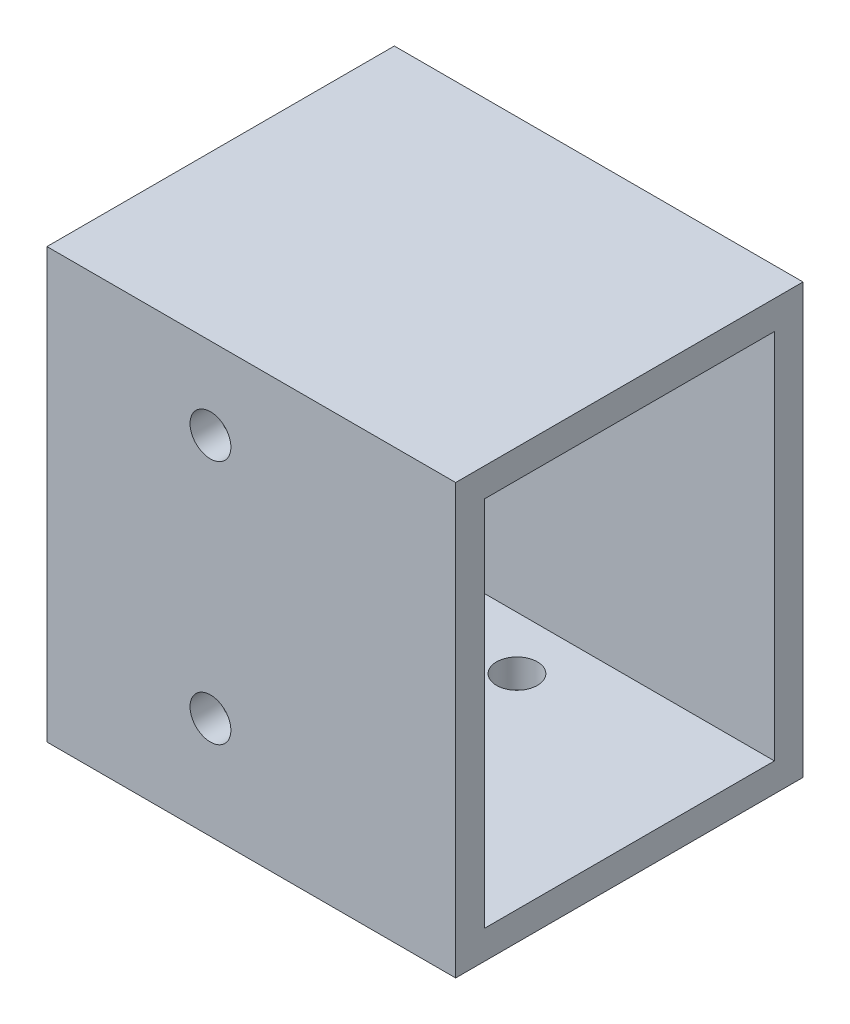
ISO-10303-21;
HEADER;
FILE_DESCRIPTION(('STEP AP214'),'2;1');
FILE_NAME('part.step','',(''),(''),'','','');
FILE_SCHEMA(('AUTOMOTIVE_DESIGN { 1 0 10303 214 1 1 1 1 }'));
ENDSEC;
DATA;
#1=APPLICATION_CONTEXT('core data for automotive mechanical design processes');
#2=APPLICATION_PROTOCOL_DEFINITION('international standard','automotive_design',2000,#1);
#3=PRODUCT_CONTEXT('',#1,'mechanical');
#4=PRODUCT('Part','Part','',(#3));
#5=PRODUCT_RELATED_PRODUCT_CATEGORY('part','',(#4));
#6=PRODUCT_DEFINITION_FORMATION('','',#4);
#7=PRODUCT_DEFINITION_CONTEXT('part definition',#1,'design');
#8=PRODUCT_DEFINITION('design','',#6,#7);
#9=PRODUCT_DEFINITION_SHAPE('','',#8);
#10=(LENGTH_UNIT() NAMED_UNIT(*) SI_UNIT(.MILLI.,.METRE.));
#11=(NAMED_UNIT(*) PLANE_ANGLE_UNIT() SI_UNIT($,.RADIAN.));
#12=(NAMED_UNIT(*) SI_UNIT($,.STERADIAN.) SOLID_ANGLE_UNIT());
#13=UNCERTAINTY_MEASURE_WITH_UNIT(LENGTH_MEASURE(1.E-05),#10,'distance_accuracy_value','');
#14=(GEOMETRIC_REPRESENTATION_CONTEXT(3) GLOBAL_UNCERTAINTY_ASSIGNED_CONTEXT((#13)) GLOBAL_UNIT_ASSIGNED_CONTEXT((#10,
#11,#12)) REPRESENTATION_CONTEXT('',''));
#15=CARTESIAN_POINT('',(0.,0.,0.));
#16=DIRECTION('',(0.,0.,1.));
#17=DIRECTION('',(1.,0.,0.));
#18=AXIS2_PLACEMENT_3D('',#15,#16,#17);
#19=CARTESIAN_POINT('',(-61.9582886225266,105.,34.5966333713851));
#20=DIRECTION('',(1.,0.,0.));
#21=DIRECTION('',(0.,0.,-1.));
#22=AXIS2_PLACEMENT_3D('',#19,#20,#21);
#23=PLANE('',#22);
#24=CARTESIAN_POINT('',(-61.9582886225266,37.5,-7.90336662861491));
#25=DIRECTION('',(-1.,0.,0.));
#26=DIRECTION('',(0.,0.,1.));
#27=AXIS2_PLACEMENT_3D('',#24,#25,#26);
#28=CIRCLE('',#27,5.);
#29=CARTESIAN_POINT('',(-61.9582886225266,37.5,-2.90336662861491));
#30=VERTEX_POINT('',#29);
#31=EDGE_CURVE('E193',#30,#30,#28,.T.);
#32=ORIENTED_EDGE('',*,*,#31,.F.);
#33=EDGE_LOOP('',(#32));
#34=FACE_BOUND('',#33,.T.);
#35=CARTESIAN_POINT('',(-61.9582886225266,52.5,-7.90336662861491));
#36=DIRECTION('',(-1.,0.,0.));
#37=DIRECTION('',(0.,0.,1.));
#38=AXIS2_PLACEMENT_3D('',#35,#36,#37);
#39=CIRCLE('',#38,5.);
#40=CARTESIAN_POINT('',(-61.9582886225266,52.5,-2.90336662861491));
#41=VERTEX_POINT('',#40);
#42=EDGE_CURVE('E182',#41,#41,#39,.T.);
#43=ORIENTED_EDGE('',*,*,#42,.F.);
#44=EDGE_LOOP('',(#43));
#45=FACE_BOUND('',#44,.T.);
#46=CARTESIAN_POINT('',(-61.9582886225266,67.5,-7.90336662861491));
#47=DIRECTION('',(-1.,0.,0.));
#48=DIRECTION('',(0.,0.,1.));
#49=AXIS2_PLACEMENT_3D('',#46,#47,#48);
#50=CIRCLE('',#49,4.99999999999999);
#51=CARTESIAN_POINT('',(-61.9582886225266,67.5,-2.90336662861492));
#52=VERTEX_POINT('',#51);
#53=EDGE_CURVE('E181',#52,#52,#50,.T.);
#54=ORIENTED_EDGE('',*,*,#53,.F.);
#55=EDGE_LOOP('',(#54));
#56=FACE_BOUND('',#55,.T.);
#57=DIRECTION('',(0.,0.,1.));
#58=VECTOR('',#57,1.);
#59=CARTESIAN_POINT('',(-61.9582886225266,0.,34.5966333713851));
#60=LINE('',#59,#58);
#61=CARTESIAN_POINT('',(-61.9582886225266,0.,-50.4033666286149));
#62=VERTEX_POINT('',#61);
#63=CARTESIAN_POINT('',(-61.9582886225266,0.,34.5966333713851));
#64=VERTEX_POINT('',#63);
#65=EDGE_CURVE('E147',#62,#64,#60,.T.);
#66=ORIENTED_EDGE('',*,*,#65,.T.);
#67=DIRECTION('',(0.,-1.,0.));
#68=VECTOR('',#67,1.);
#69=CARTESIAN_POINT('',(-61.9582886225266,105.,34.5966333713851));
#70=LINE('',#69,#68);
#71=CARTESIAN_POINT('',(-61.9582886225266,105.,34.5966333713851));
#72=VERTEX_POINT('',#71);
#73=EDGE_CURVE('E11',#72,#64,#70,.T.);
#74=ORIENTED_EDGE('',*,*,#73,.F.);
#75=DIRECTION('',(0.,0.,1.));
#76=VECTOR('',#75,1.);
#77=CARTESIAN_POINT('',(-61.9582886225266,105.,34.5966333713851));
#78=LINE('',#77,#76);
#79=CARTESIAN_POINT('',(-61.9582886225266,105.,-50.4033666286149));
#80=VERTEX_POINT('',#79);
#81=EDGE_CURVE('E151',#80,#72,#78,.T.);
#82=ORIENTED_EDGE('',*,*,#81,.F.);
#83=DIRECTION('',(0.,-1.,0.));
#84=VECTOR('',#83,1.);
#85=CARTESIAN_POINT('',(-61.9582886225266,105.,-50.4033666286149));
#86=LINE('',#85,#84);
#87=EDGE_CURVE('E157',#80,#62,#86,.T.);
#88=ORIENTED_EDGE('',*,*,#87,.T.);
#89=EDGE_LOOP('',(#66,#74,#82,#88));
#90=FACE_BOUND('',#89,.T.);
#91=ADVANCED_FACE('F33',(#34,#45,#56,#90),#23,.F.);
#92=CARTESIAN_POINT('',(-61.9582886225266,105.,34.5966333713851));
#93=DIRECTION('',(0.,0.,-1.));
#94=DIRECTION('',(-1.,0.,0.));
#95=AXIS2_PLACEMENT_3D('',#92,#93,#94);
#96=PLANE('',#95);
#97=CARTESIAN_POINT('',(-21.9582886225266,85.,34.5966333713851));
#98=DIRECTION('',(0.,0.,1.));
#99=DIRECTION('',(1.,0.,0.));
#100=AXIS2_PLACEMENT_3D('',#97,#98,#99);
#101=CIRCLE('',#100,5.);
#102=CARTESIAN_POINT('',(-16.9582886225266,85.,34.5966333713851));
#103=VERTEX_POINT('',#102);
#104=EDGE_CURVE('E175',#103,#103,#101,.T.);
#105=ORIENTED_EDGE('',*,*,#104,.F.);
#106=EDGE_LOOP('',(#105));
#107=FACE_BOUND('',#106,.T.);
#108=CARTESIAN_POINT('',(-21.9582886225266,25.,34.5966333713851));
#109=DIRECTION('',(0.,0.,1.));
#110=DIRECTION('',(1.,0.,0.));
#111=AXIS2_PLACEMENT_3D('',#108,#109,#110);
#112=CIRCLE('',#111,5.);
#113=CARTESIAN_POINT('',(-16.9582886225266,25.,34.5966333713851));
#114=VERTEX_POINT('',#113);
#115=EDGE_CURVE('E134',#114,#114,#112,.T.);
#116=ORIENTED_EDGE('',*,*,#115,.F.);
#117=EDGE_LOOP('',(#116));
#118=FACE_BOUND('',#117,.T.);
#119=DIRECTION('',(1.,0.,0.));
#120=VECTOR('',#119,1.);
#121=CARTESIAN_POINT('',(-61.9582886225266,0.,34.5966333713851));
#122=LINE('',#121,#120);
#123=CARTESIAN_POINT('',(38.0417113774734,0.,34.5966333713851));
#124=VERTEX_POINT('',#123);
#125=EDGE_CURVE('E160',#64,#124,#122,.T.);
#126=ORIENTED_EDGE('',*,*,#125,.T.);
#127=DIRECTION('',(0.,-1.,0.));
#128=VECTOR('',#127,1.);
#129=CARTESIAN_POINT('',(38.0417113774734,105.,34.5966333713851));
#130=LINE('',#129,#128);
#131=CARTESIAN_POINT('',(38.0417113774734,105.,34.5966333713851));
#132=VERTEX_POINT('',#131);
#133=EDGE_CURVE('E41',#132,#124,#130,.T.);
#134=ORIENTED_EDGE('',*,*,#133,.F.);
#135=DIRECTION('',(1.,0.,0.));
#136=VECTOR('',#135,1.);
#137=CARTESIAN_POINT('',(-61.9582886225266,105.,34.5966333713851));
#138=LINE('',#137,#136);
#139=EDGE_CURVE('E86',#72,#132,#138,.T.);
#140=ORIENTED_EDGE('',*,*,#139,.F.);
#141=ORIENTED_EDGE('',*,*,#73,.T.);
#142=EDGE_LOOP('',(#126,#134,#140,#141));
#143=FACE_BOUND('',#142,.T.);
#144=ADVANCED_FACE('F205',(#107,#118,#143),#96,.F.);
#145=CARTESIAN_POINT('',(38.0417113774734,105.,34.5966333713851));
#146=DIRECTION('',(-1.,0.,0.));
#147=DIRECTION('',(0.,0.,1.));
#148=AXIS2_PLACEMENT_3D('',#145,#146,#147);
#149=PLANE('',#148);
#150=DIRECTION('',(0.,0.,-1.));
#151=VECTOR('',#150,1.);
#152=CARTESIAN_POINT('',(38.0417113774734,7.,27.5966333713851));
#153=LINE('',#152,#151);
#154=CARTESIAN_POINT('',(38.0417113774734,7.00000000000001,27.5966333713851));
#155=VERTEX_POINT('',#154);
#156=CARTESIAN_POINT('',(38.0417113774734,7.,-43.4033666286149));
#157=VERTEX_POINT('',#156);
#158=EDGE_CURVE('E140',#155,#157,#153,.T.);
#159=ORIENTED_EDGE('',*,*,#158,.F.);
#160=DIRECTION('',(0.,-1.,0.));
#161=VECTOR('',#160,1.);
#162=CARTESIAN_POINT('',(38.0417113774734,98.,27.5966333713851));
#163=LINE('',#162,#161);
#164=CARTESIAN_POINT('',(38.0417113774734,98.,27.5966333713851));
#165=VERTEX_POINT('',#164);
#166=EDGE_CURVE('E49',#165,#155,#163,.T.);
#167=ORIENTED_EDGE('',*,*,#166,.F.);
#168=DIRECTION('',(0.,0.,1.));
#169=VECTOR('',#168,1.);
#170=CARTESIAN_POINT('',(38.0417113774734,98.,27.5966333713851));
#171=LINE('',#170,#169);
#172=CARTESIAN_POINT('',(38.0417113774734,98.,-43.4033666286149));
#173=VERTEX_POINT('',#172);
#174=EDGE_CURVE('E128',#173,#165,#171,.T.);
#175=ORIENTED_EDGE('',*,*,#174,.F.);
#176=DIRECTION('',(0.,1.,0.));
#177=VECTOR('',#176,1.);
#178=CARTESIAN_POINT('',(38.0417113774734,98.,-43.4033666286149));
#179=LINE('',#178,#177);
#180=EDGE_CURVE('E131',#157,#173,#179,.T.);
#181=ORIENTED_EDGE('',*,*,#180,.F.);
#182=EDGE_LOOP('',(#159,#167,#175,#181));
#183=FACE_BOUND('',#182,.T.);
#184=DIRECTION('',(0.,0.,-1.));
#185=VECTOR('',#184,1.);
#186=CARTESIAN_POINT('',(38.0417113774734,0.,34.5966333713851));
#187=LINE('',#186,#185);
#188=CARTESIAN_POINT('',(38.0417113774734,0.,-50.4033666286149));
#189=VERTEX_POINT('',#188);
#190=EDGE_CURVE('E162',#124,#189,#187,.T.);
#191=ORIENTED_EDGE('',*,*,#190,.T.);
#192=DIRECTION('',(0.,-1.,0.));
#193=VECTOR('',#192,1.);
#194=CARTESIAN_POINT('',(38.0417113774734,105.,-50.4033666286149));
#195=LINE('',#194,#193);
#196=CARTESIAN_POINT('',(38.0417113774734,105.,-50.4033666286149));
#197=VERTEX_POINT('',#196);
#198=EDGE_CURVE('E166',#197,#189,#195,.T.);
#199=ORIENTED_EDGE('',*,*,#198,.F.);
#200=DIRECTION('',(0.,0.,-1.));
#201=VECTOR('',#200,1.);
#202=CARTESIAN_POINT('',(38.0417113774734,105.,34.5966333713851));
#203=LINE('',#202,#201);
#204=EDGE_CURVE('E154',#132,#197,#203,.T.);
#205=ORIENTED_EDGE('',*,*,#204,.F.);
#206=ORIENTED_EDGE('',*,*,#133,.T.);
#207=EDGE_LOOP('',(#191,#199,#205,#206));
#208=FACE_BOUND('',#207,.T.);
#209=ADVANCED_FACE('F208',(#183,#208),#149,.F.);
#210=CARTESIAN_POINT('',(-61.9582886225266,105.,-50.4033666286149));
#211=DIRECTION('',(0.,0.,1.));
#212=DIRECTION('',(1.,0.,0.));
#213=AXIS2_PLACEMENT_3D('',#210,#211,#212);
#214=PLANE('',#213);
#215=DIRECTION('',(-1.,0.,0.));
#216=VECTOR('',#215,1.);
#217=CARTESIAN_POINT('',(-61.9582886225266,0.,-50.4033666286149));
#218=LINE('',#217,#216);
#219=EDGE_CURVE('E79',#189,#62,#218,.T.);
#220=ORIENTED_EDGE('',*,*,#219,.T.);
#221=ORIENTED_EDGE('',*,*,#87,.F.);
#222=DIRECTION('',(-1.,0.,0.));
#223=VECTOR('',#222,1.);
#224=CARTESIAN_POINT('',(-61.9582886225266,105.,-50.4033666286149));
#225=LINE('',#224,#223);
#226=EDGE_CURVE('E58',#197,#80,#225,.T.);
#227=ORIENTED_EDGE('',*,*,#226,.F.);
#228=ORIENTED_EDGE('',*,*,#198,.T.);
#229=EDGE_LOOP('',(#220,#221,#227,#228));
#230=FACE_BOUND('',#229,.T.);
#231=ADVANCED_FACE('F221',(#230),#214,.F.);
#232=CARTESIAN_POINT('',(0.,105.,0.));
#233=DIRECTION('',(0.,-1.,0.));
#234=DIRECTION('',(0.,0.,-1.));
#235=AXIS2_PLACEMENT_3D('',#232,#233,#234);
#236=PLANE('',#235);
#237=ORIENTED_EDGE('',*,*,#81,.T.);
#238=ORIENTED_EDGE('',*,*,#139,.T.);
#239=ORIENTED_EDGE('',*,*,#204,.T.);
#240=ORIENTED_EDGE('',*,*,#226,.T.);
#241=EDGE_LOOP('',(#237,#238,#239,#240));
#242=FACE_BOUND('',#241,.T.);
#243=ADVANCED_FACE('F223',(#242),#236,.F.);
#244=CARTESIAN_POINT('',(0.,0.,0.));
#245=DIRECTION('',(0.,-1.,0.));
#246=DIRECTION('',(0.,0.,-1.));
#247=AXIS2_PLACEMENT_3D('',#244,#245,#246);
#248=PLANE('',#247);
#249=CARTESIAN_POINT('',(-11.9582886225266,0.,-30.4033666286149));
#250=DIRECTION('',(0.,-1.,0.));
#251=DIRECTION('',(0.,0.,-1.));
#252=AXIS2_PLACEMENT_3D('',#249,#250,#251);
#253=CIRCLE('',#252,5.);
#254=CARTESIAN_POINT('',(-11.9582886225266,0.,-35.4033666286149));
#255=VERTEX_POINT('',#254);
#256=EDGE_CURVE('E178',#255,#255,#253,.T.);
#257=ORIENTED_EDGE('',*,*,#256,.F.);
#258=EDGE_LOOP('',(#257));
#259=FACE_BOUND('',#258,.T.);
#260=ORIENTED_EDGE('',*,*,#65,.F.);
#261=ORIENTED_EDGE('',*,*,#219,.F.);
#262=ORIENTED_EDGE('',*,*,#190,.F.);
#263=ORIENTED_EDGE('',*,*,#125,.F.);
#264=EDGE_LOOP('',(#260,#261,#262,#263));
#265=FACE_BOUND('',#264,.T.);
#266=ADVANCED_FACE('F218',(#259,#265),#248,.T.);
#267=CARTESIAN_POINT('',(-51.9582886225266,98.,27.5966333713851));
#268=DIRECTION('',(0.,0.,1.));
#269=DIRECTION('',(0.,-1.,0.));
#270=AXIS2_PLACEMENT_3D('',#267,#268,#269);
#271=PLANE('',#270);
#272=CARTESIAN_POINT('',(-21.9582886225266,85.,27.5966333713851));
#273=DIRECTION('',(0.,0.,1.));
#274=DIRECTION('',(0.,-1.,0.));
#275=AXIS2_PLACEMENT_3D('',#272,#273,#274);
#276=CIRCLE('',#275,5.);
#277=CARTESIAN_POINT('',(-21.9582886225266,80.,27.5966333713851));
#278=VERTEX_POINT('',#277);
#279=EDGE_CURVE('E172',#278,#278,#276,.T.);
#280=ORIENTED_EDGE('',*,*,#279,.T.);
#281=EDGE_LOOP('',(#280));
#282=FACE_BOUND('',#281,.T.);
#283=CARTESIAN_POINT('',(-21.9582886225266,25.,27.5966333713851));
#284=DIRECTION('',(0.,0.,1.));
#285=DIRECTION('',(0.,-1.,0.));
#286=AXIS2_PLACEMENT_3D('',#283,#284,#285);
#287=CIRCLE('',#286,5.);
#288=CARTESIAN_POINT('',(-21.9582886225266,20.,27.5966333713851));
#289=VERTEX_POINT('',#288);
#290=EDGE_CURVE('E141',#289,#289,#287,.T.);
#291=ORIENTED_EDGE('',*,*,#290,.T.);
#292=EDGE_LOOP('',(#291));
#293=FACE_BOUND('',#292,.T.);
#294=ORIENTED_EDGE('',*,*,#166,.T.);
#295=DIRECTION('',(1.,0.,0.));
#296=VECTOR('',#295,1.);
#297=CARTESIAN_POINT('',(-51.9582886225266,7.,27.5966333713851));
#298=LINE('',#297,#296);
#299=CARTESIAN_POINT('',(-51.9582886225266,7.,27.5966333713851));
#300=VERTEX_POINT('',#299);
#301=EDGE_CURVE('E106',#300,#155,#298,.T.);
#302=ORIENTED_EDGE('',*,*,#301,.F.);
#303=DIRECTION('',(0.,-1.,0.));
#304=VECTOR('',#303,1.);
#305=CARTESIAN_POINT('',(-51.9582886225266,98.,27.5966333713851));
#306=LINE('',#305,#304);
#307=CARTESIAN_POINT('',(-51.9582886225266,98.,27.5966333713851));
#308=VERTEX_POINT('',#307);
#309=EDGE_CURVE('E110',#308,#300,#306,.T.);
#310=ORIENTED_EDGE('',*,*,#309,.F.);
#311=DIRECTION('',(1.,0.,0.));
#312=VECTOR('',#311,1.);
#313=CARTESIAN_POINT('',(-51.9582886225266,98.,27.5966333713851));
#314=LINE('',#313,#312);
#315=EDGE_CURVE('E145',#308,#165,#314,.T.);
#316=ORIENTED_EDGE('',*,*,#315,.T.);
#317=EDGE_LOOP('',(#294,#302,#310,#316));
#318=FACE_BOUND('',#317,.T.);
#319=ADVANCED_FACE('F108',(#282,#293,#318),#271,.F.);
#320=CARTESIAN_POINT('',(-51.9582886225266,98.,27.5966333713851));
#321=DIRECTION('',(0.,1.,0.));
#322=DIRECTION('',(0.,0.,1.));
#323=AXIS2_PLACEMENT_3D('',#320,#321,#322);
#324=PLANE('',#323);
#325=ORIENTED_EDGE('',*,*,#174,.T.);
#326=ORIENTED_EDGE('',*,*,#315,.F.);
#327=DIRECTION('',(0.,0.,1.));
#328=VECTOR('',#327,1.);
#329=CARTESIAN_POINT('',(-51.9582886225266,98.,27.5966333713851));
#330=LINE('',#329,#328);
#331=CARTESIAN_POINT('',(-51.9582886225266,98.,-43.4033666286149));
#332=VERTEX_POINT('',#331);
#333=EDGE_CURVE('E116',#332,#308,#330,.T.);
#334=ORIENTED_EDGE('',*,*,#333,.F.);
#335=DIRECTION('',(1.,0.,0.));
#336=VECTOR('',#335,1.);
#337=CARTESIAN_POINT('',(-51.9582886225266,98.,-43.4033666286149));
#338=LINE('',#337,#336);
#339=EDGE_CURVE('E148',#332,#173,#338,.T.);
#340=ORIENTED_EDGE('',*,*,#339,.T.);
#341=EDGE_LOOP('',(#325,#326,#334,#340));
#342=FACE_BOUND('',#341,.T.);
#343=ADVANCED_FACE('F269',(#342),#324,.F.);
#344=CARTESIAN_POINT('',(-51.9582886225266,98.,-43.4033666286149));
#345=DIRECTION('',(0.,0.,-1.));
#346=DIRECTION('',(0.,1.,0.));
#347=AXIS2_PLACEMENT_3D('',#344,#345,#346);
#348=PLANE('',#347);
#349=ORIENTED_EDGE('',*,*,#180,.T.);
#350=ORIENTED_EDGE('',*,*,#339,.F.);
#351=DIRECTION('',(0.,1.,0.));
#352=VECTOR('',#351,1.);
#353=CARTESIAN_POINT('',(-51.9582886225266,98.,-43.4033666286149));
#354=LINE('',#353,#352);
#355=CARTESIAN_POINT('',(-51.9582886225266,7.,-43.4033666286149));
#356=VERTEX_POINT('',#355);
#357=EDGE_CURVE('E124',#356,#332,#354,.T.);
#358=ORIENTED_EDGE('',*,*,#357,.F.);
#359=DIRECTION('',(1.,0.,0.));
#360=VECTOR('',#359,1.);
#361=CARTESIAN_POINT('',(-51.9582886225266,7.,-43.4033666286149));
#362=LINE('',#361,#360);
#363=EDGE_CURVE('E115',#356,#157,#362,.T.);
#364=ORIENTED_EDGE('',*,*,#363,.T.);
#365=EDGE_LOOP('',(#349,#350,#358,#364));
#366=FACE_BOUND('',#365,.T.);
#367=ADVANCED_FACE('F272',(#366),#348,.F.);
#368=CARTESIAN_POINT('',(-51.9582886225266,7.,27.5966333713851));
#369=DIRECTION('',(0.,-1.,0.));
#370=DIRECTION('',(0.,0.,-1.));
#371=AXIS2_PLACEMENT_3D('',#368,#369,#370);
#372=PLANE('',#371);
#373=CARTESIAN_POINT('',(-11.9582886225266,7.,-30.4033666286149));
#374=DIRECTION('',(0.,-1.,0.));
#375=DIRECTION('',(0.,0.,-1.));
#376=AXIS2_PLACEMENT_3D('',#373,#374,#375);
#377=CIRCLE('',#376,5.);
#378=CARTESIAN_POINT('',(-11.9582886225266,7.,-35.4033666286149));
#379=VERTEX_POINT('',#378);
#380=EDGE_CURVE('E176',#379,#379,#377,.T.);
#381=ORIENTED_EDGE('',*,*,#380,.T.);
#382=EDGE_LOOP('',(#381));
#383=FACE_BOUND('',#382,.T.);
#384=ORIENTED_EDGE('',*,*,#158,.T.);
#385=ORIENTED_EDGE('',*,*,#363,.F.);
#386=DIRECTION('',(0.,0.,-1.));
#387=VECTOR('',#386,1.);
#388=CARTESIAN_POINT('',(-51.9582886225266,7.,27.5966333713851));
#389=LINE('',#388,#387);
#390=EDGE_CURVE('E119',#300,#356,#389,.T.);
#391=ORIENTED_EDGE('',*,*,#390,.F.);
#392=ORIENTED_EDGE('',*,*,#301,.T.);
#393=EDGE_LOOP('',(#384,#385,#391,#392));
#394=FACE_BOUND('',#393,.T.);
#395=ADVANCED_FACE('F120',(#383,#394),#372,.F.);
#396=CARTESIAN_POINT('',(-51.9582886225266,0.,0.));
#397=DIRECTION('',(1.,0.,0.));
#398=DIRECTION('',(0.,0.,-1.));
#399=AXIS2_PLACEMENT_3D('',#396,#397,#398);
#400=PLANE('',#399);
#401=CARTESIAN_POINT('',(-51.9582886225266,37.5,-7.90336662861491));
#402=DIRECTION('',(1.,0.,0.));
#403=DIRECTION('',(0.,0.,-1.));
#404=AXIS2_PLACEMENT_3D('',#401,#402,#403);
#405=CIRCLE('',#404,5.);
#406=CARTESIAN_POINT('',(-51.9582886225266,37.5,-12.9033666286149));
#407=VERTEX_POINT('',#406);
#408=EDGE_CURVE('E36',#407,#407,#405,.T.);
#409=ORIENTED_EDGE('',*,*,#408,.F.);
#410=EDGE_LOOP('',(#409));
#411=FACE_BOUND('',#410,.T.);
#412=CARTESIAN_POINT('',(-51.9582886225266,52.5,-7.90336662861491));
#413=DIRECTION('',(1.,0.,0.));
#414=DIRECTION('',(0.,0.,-1.));
#415=AXIS2_PLACEMENT_3D('',#412,#413,#414);
#416=CIRCLE('',#415,5.);
#417=CARTESIAN_POINT('',(-51.9582886225266,52.5,-12.9033666286149));
#418=VERTEX_POINT('',#417);
#419=EDGE_CURVE('E179',#418,#418,#416,.T.);
#420=ORIENTED_EDGE('',*,*,#419,.F.);
#421=EDGE_LOOP('',(#420));
#422=FACE_BOUND('',#421,.T.);
#423=CARTESIAN_POINT('',(-51.9582886225266,67.5,-7.90336662861491));
#424=DIRECTION('',(1.,0.,0.));
#425=DIRECTION('',(0.,0.,-1.));
#426=AXIS2_PLACEMENT_3D('',#423,#424,#425);
#427=CIRCLE('',#426,4.99999999999999);
#428=CARTESIAN_POINT('',(-51.9582886225266,67.5,-12.9033666286149));
#429=VERTEX_POINT('',#428);
#430=EDGE_CURVE('E186',#429,#429,#427,.T.);
#431=ORIENTED_EDGE('',*,*,#430,.F.);
#432=EDGE_LOOP('',(#431));
#433=FACE_BOUND('',#432,.T.);
#434=ORIENTED_EDGE('',*,*,#309,.T.);
#435=ORIENTED_EDGE('',*,*,#390,.T.);
#436=ORIENTED_EDGE('',*,*,#357,.T.);
#437=ORIENTED_EDGE('',*,*,#333,.T.);
#438=EDGE_LOOP('',(#434,#435,#436,#437));
#439=FACE_BOUND('',#438,.T.);
#440=ADVANCED_FACE('F126',(#411,#422,#433,#439),#400,.T.);
#441=CARTESIAN_POINT('',(-21.9582886225266,25.,34.5966333713851));
#442=DIRECTION('',(0.,0.,1.));
#443=DIRECTION('',(1.,0.,0.));
#444=AXIS2_PLACEMENT_3D('',#441,#442,#443);
#445=CYLINDRICAL_SURFACE('',#444,5.);
#446=ORIENTED_EDGE('',*,*,#115,.T.);
#447=EDGE_LOOP('',(#446));
#448=FACE_BOUND('',#447,.T.);
#449=ORIENTED_EDGE('',*,*,#290,.F.);
#450=EDGE_LOOP('',(#449));
#451=FACE_BOUND('',#450,.T.);
#452=ADVANCED_FACE('F263',(#448,#451),#445,.F.);
#453=CARTESIAN_POINT('',(-21.9582886225266,85.,34.5966333713851));
#454=DIRECTION('',(0.,0.,1.));
#455=DIRECTION('',(1.,0.,0.));
#456=AXIS2_PLACEMENT_3D('',#453,#454,#455);
#457=CYLINDRICAL_SURFACE('',#456,5.);
#458=ORIENTED_EDGE('',*,*,#104,.T.);
#459=EDGE_LOOP('',(#458));
#460=FACE_BOUND('',#459,.T.);
#461=ORIENTED_EDGE('',*,*,#279,.F.);
#462=EDGE_LOOP('',(#461));
#463=FACE_BOUND('',#462,.T.);
#464=ADVANCED_FACE('F202',(#460,#463),#457,.F.);
#465=CARTESIAN_POINT('',(-11.9582886225266,0.,-30.4033666286149));
#466=DIRECTION('',(0.,-1.,0.));
#467=DIRECTION('',(0.,0.,-1.));
#468=AXIS2_PLACEMENT_3D('',#465,#466,#467);
#469=CYLINDRICAL_SURFACE('',#468,5.);
#470=ORIENTED_EDGE('',*,*,#256,.T.);
#471=EDGE_LOOP('',(#470));
#472=FACE_BOUND('',#471,.T.);
#473=ORIENTED_EDGE('',*,*,#380,.F.);
#474=EDGE_LOOP('',(#473));
#475=FACE_BOUND('',#474,.T.);
#476=ADVANCED_FACE('F248',(#472,#475),#469,.F.);
#477=CARTESIAN_POINT('',(-61.9582886225266,67.5,-7.90336662861491));
#478=DIRECTION('',(-1.,0.,0.));
#479=DIRECTION('',(0.,0.,1.));
#480=AXIS2_PLACEMENT_3D('',#477,#478,#479);
#481=CYLINDRICAL_SURFACE('',#480,4.99999999999999);
#482=ORIENTED_EDGE('',*,*,#430,.T.);
#483=EDGE_LOOP('',(#482));
#484=FACE_BOUND('',#483,.T.);
#485=ORIENTED_EDGE('',*,*,#53,.T.);
#486=EDGE_LOOP('',(#485));
#487=FACE_BOUND('',#486,.T.);
#488=ADVANCED_FACE('F245',(#484,#487),#481,.F.);
#489=CARTESIAN_POINT('',(-61.9582886225266,52.5,-7.90336662861491));
#490=DIRECTION('',(-1.,0.,0.));
#491=DIRECTION('',(0.,0.,1.));
#492=AXIS2_PLACEMENT_3D('',#489,#490,#491);
#493=CYLINDRICAL_SURFACE('',#492,5.);
#494=ORIENTED_EDGE('',*,*,#419,.T.);
#495=EDGE_LOOP('',(#494));
#496=FACE_BOUND('',#495,.T.);
#497=ORIENTED_EDGE('',*,*,#42,.T.);
#498=EDGE_LOOP('',(#497));
#499=FACE_BOUND('',#498,.T.);
#500=ADVANCED_FACE('F247',(#496,#499),#493,.F.);
#501=CARTESIAN_POINT('',(-61.9582886225266,37.5,-7.90336662861491));
#502=DIRECTION('',(-1.,0.,0.));
#503=DIRECTION('',(0.,0.,1.));
#504=AXIS2_PLACEMENT_3D('',#501,#502,#503);
#505=CYLINDRICAL_SURFACE('',#504,5.);
#506=ORIENTED_EDGE('',*,*,#408,.T.);
#507=EDGE_LOOP('',(#506));
#508=FACE_BOUND('',#507,.T.);
#509=ORIENTED_EDGE('',*,*,#31,.T.);
#510=EDGE_LOOP('',(#509));
#511=FACE_BOUND('',#510,.T.);
#512=ADVANCED_FACE('F255',(#508,#511),#505,.F.);
#513=CLOSED_SHELL('',(#91,#144,#209,#231,#243,#266,#319,#343,#367,#395,#440,#452,#464,#476,#488,
#500,#512));
#514=MANIFOLD_SOLID_BREP('B2',#513);
#515=ADVANCED_BREP_SHAPE_REPRESENTATION('',(#18,#514),#14);
#516=SHAPE_DEFINITION_REPRESENTATION(#9,#515);
ENDSEC;
END-ISO-10303-21;
